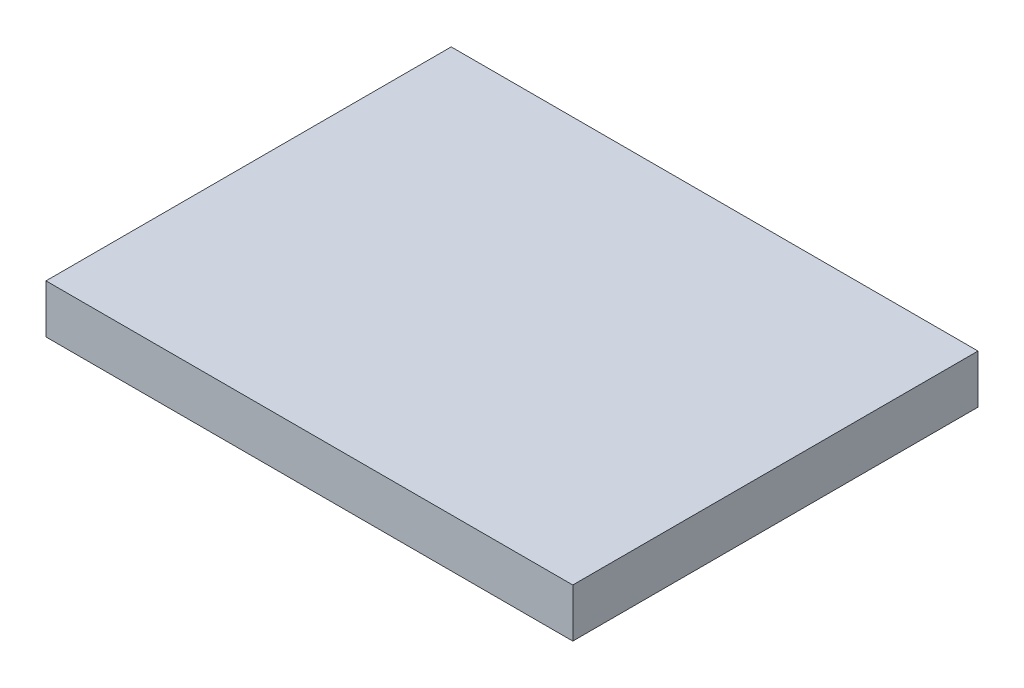
ISO-10303-21;
HEADER;
FILE_DESCRIPTION(('STEP AP214'),'2;1');
FILE_NAME('part.step','',(''),(''),'','','');
FILE_SCHEMA(('AUTOMOTIVE_DESIGN { 1 0 10303 214 1 1 1 1 }'));
ENDSEC;
DATA;
#1=APPLICATION_CONTEXT('core data for automotive mechanical design processes');
#2=APPLICATION_PROTOCOL_DEFINITION('international standard','automotive_design',2000,#1);
#3=PRODUCT_CONTEXT('',#1,'mechanical');
#4=PRODUCT('Part','Part','',(#3));
#5=PRODUCT_RELATED_PRODUCT_CATEGORY('part','',(#4));
#6=PRODUCT_DEFINITION_FORMATION('','',#4);
#7=PRODUCT_DEFINITION_CONTEXT('part definition',#1,'design');
#8=PRODUCT_DEFINITION('design','',#6,#7);
#9=PRODUCT_DEFINITION_SHAPE('','',#8);
#10=(LENGTH_UNIT() NAMED_UNIT(*) SI_UNIT(.MILLI.,.METRE.));
#11=(NAMED_UNIT(*) PLANE_ANGLE_UNIT() SI_UNIT($,.RADIAN.));
#12=(NAMED_UNIT(*) SI_UNIT($,.STERADIAN.) SOLID_ANGLE_UNIT());
#13=UNCERTAINTY_MEASURE_WITH_UNIT(LENGTH_MEASURE(1.E-05),#10,'distance_accuracy_value','');
#14=(GEOMETRIC_REPRESENTATION_CONTEXT(3) GLOBAL_UNCERTAINTY_ASSIGNED_CONTEXT((#13)) GLOBAL_UNIT_ASSIGNED_CONTEXT((#10,
#11,#12)) REPRESENTATION_CONTEXT('',''));
#15=CARTESIAN_POINT('',(0.,0.,0.));
#16=DIRECTION('',(0.,0.,1.));
#17=DIRECTION('',(1.,0.,0.));
#18=AXIS2_PLACEMENT_3D('',#15,#16,#17);
#19=CARTESIAN_POINT('',(0.,12.,0.));
#20=DIRECTION('',(1.,0.,0.));
#21=DIRECTION('',(0.,0.,-1.));
#22=AXIS2_PLACEMENT_3D('',#19,#20,#21);
#23=PLANE('',#22);
#24=DIRECTION('',(0.,0.,1.));
#25=VECTOR('',#24,1.);
#26=CARTESIAN_POINT('',(0.,0.,0.));
#27=LINE('',#26,#25);
#28=CARTESIAN_POINT('',(0.,0.,-100.));
#29=VERTEX_POINT('',#28);
#30=CARTESIAN_POINT('',(0.,0.,0.));
#31=VERTEX_POINT('',#30);
#32=EDGE_CURVE('E96',#29,#31,#27,.T.);
#33=ORIENTED_EDGE('',*,*,#32,.T.);
#34=DIRECTION('',(0.,-1.,0.));
#35=VECTOR('',#34,1.);
#36=CARTESIAN_POINT('',(0.,12.,0.));
#37=LINE('',#36,#35);
#38=CARTESIAN_POINT('',(0.,12.,0.));
#39=VERTEX_POINT('',#38);
#40=EDGE_CURVE('E11',#39,#31,#37,.T.);
#41=ORIENTED_EDGE('',*,*,#40,.F.);
#42=DIRECTION('',(0.,0.,1.));
#43=VECTOR('',#42,1.);
#44=CARTESIAN_POINT('',(0.,12.,0.));
#45=LINE('',#44,#43);
#46=CARTESIAN_POINT('',(0.,12.,-100.));
#47=VERTEX_POINT('',#46);
#48=EDGE_CURVE('E84',#47,#39,#45,.T.);
#49=ORIENTED_EDGE('',*,*,#48,.F.);
#50=DIRECTION('',(0.,-1.,0.));
#51=VECTOR('',#50,1.);
#52=CARTESIAN_POINT('',(0.,12.,-100.));
#53=LINE('',#52,#51);
#54=EDGE_CURVE('E92',#47,#29,#53,.T.);
#55=ORIENTED_EDGE('',*,*,#54,.T.);
#56=EDGE_LOOP('',(#33,#41,#49,#55));
#57=FACE_BOUND('',#56,.T.);
#58=ADVANCED_FACE('F33',(#57),#23,.F.);
#59=CARTESIAN_POINT('',(0.,12.,0.));
#60=DIRECTION('',(0.,0.,-1.));
#61=DIRECTION('',(-1.,0.,0.));
#62=AXIS2_PLACEMENT_3D('',#59,#60,#61);
#63=PLANE('',#62);
#64=DIRECTION('',(1.,0.,0.));
#65=VECTOR('',#64,1.);
#66=CARTESIAN_POINT('',(0.,0.,0.));
#67=LINE('',#66,#65);
#68=CARTESIAN_POINT('',(130.,0.,0.));
#69=VERTEX_POINT('',#68);
#70=EDGE_CURVE('E88',#31,#69,#67,.T.);
#71=ORIENTED_EDGE('',*,*,#70,.T.);
#72=DIRECTION('',(0.,-1.,0.));
#73=VECTOR('',#72,1.);
#74=CARTESIAN_POINT('',(130.,12.,0.));
#75=LINE('',#74,#73);
#76=CARTESIAN_POINT('',(130.,12.,0.));
#77=VERTEX_POINT('',#76);
#78=EDGE_CURVE('E41',#77,#69,#75,.T.);
#79=ORIENTED_EDGE('',*,*,#78,.F.);
#80=DIRECTION('',(1.,0.,0.));
#81=VECTOR('',#80,1.);
#82=CARTESIAN_POINT('',(0.,12.,0.));
#83=LINE('',#82,#81);
#84=EDGE_CURVE('E79',#39,#77,#83,.T.);
#85=ORIENTED_EDGE('',*,*,#84,.F.);
#86=ORIENTED_EDGE('',*,*,#40,.T.);
#87=EDGE_LOOP('',(#71,#79,#85,#86));
#88=FACE_BOUND('',#87,.T.);
#89=ADVANCED_FACE('F87',(#88),#63,.F.);
#90=CARTESIAN_POINT('',(130.,12.,0.));
#91=DIRECTION('',(-1.,0.,0.));
#92=DIRECTION('',(0.,0.,1.));
#93=AXIS2_PLACEMENT_3D('',#90,#91,#92);
#94=PLANE('',#93);
#95=DIRECTION('',(0.,0.,-1.));
#96=VECTOR('',#95,1.);
#97=CARTESIAN_POINT('',(130.,0.,0.));
#98=LINE('',#97,#96);
#99=CARTESIAN_POINT('',(130.,0.,-100.));
#100=VERTEX_POINT('',#99);
#101=EDGE_CURVE('E66',#69,#100,#98,.T.);
#102=ORIENTED_EDGE('',*,*,#101,.T.);
#103=DIRECTION('',(0.,-1.,0.));
#104=VECTOR('',#103,1.);
#105=CARTESIAN_POINT('',(130.,12.,-100.));
#106=LINE('',#105,#104);
#107=CARTESIAN_POINT('',(130.,12.,-100.));
#108=VERTEX_POINT('',#107);
#109=EDGE_CURVE('E89',#108,#100,#106,.T.);
#110=ORIENTED_EDGE('',*,*,#109,.F.);
#111=DIRECTION('',(0.,0.,-1.));
#112=VECTOR('',#111,1.);
#113=CARTESIAN_POINT('',(130.,12.,0.));
#114=LINE('',#113,#112);
#115=EDGE_CURVE('E82',#77,#108,#114,.T.);
#116=ORIENTED_EDGE('',*,*,#115,.F.);
#117=ORIENTED_EDGE('',*,*,#78,.T.);
#118=EDGE_LOOP('',(#102,#110,#116,#117));
#119=FACE_BOUND('',#118,.T.);
#120=ADVANCED_FACE('F90',(#119),#94,.F.);
#121=CARTESIAN_POINT('',(0.,12.,-100.));
#122=DIRECTION('',(0.,0.,1.));
#123=DIRECTION('',(1.,0.,0.));
#124=AXIS2_PLACEMENT_3D('',#121,#122,#123);
#125=PLANE('',#124);
#126=DIRECTION('',(-1.,0.,0.));
#127=VECTOR('',#126,1.);
#128=CARTESIAN_POINT('',(0.,0.,-100.));
#129=LINE('',#128,#127);
#130=EDGE_CURVE('E72',#100,#29,#129,.T.);
#131=ORIENTED_EDGE('',*,*,#130,.T.);
#132=ORIENTED_EDGE('',*,*,#54,.F.);
#133=DIRECTION('',(-1.,0.,0.));
#134=VECTOR('',#133,1.);
#135=CARTESIAN_POINT('',(0.,12.,-100.));
#136=LINE('',#135,#134);
#137=EDGE_CURVE('E49',#108,#47,#136,.T.);
#138=ORIENTED_EDGE('',*,*,#137,.F.);
#139=ORIENTED_EDGE('',*,*,#109,.T.);
#140=EDGE_LOOP('',(#131,#132,#138,#139));
#141=FACE_BOUND('',#140,.T.);
#142=ADVANCED_FACE('F103',(#141),#125,.F.);
#143=CARTESIAN_POINT('',(0.,12.,0.));
#144=DIRECTION('',(0.,-1.,0.));
#145=DIRECTION('',(0.,0.,-1.));
#146=AXIS2_PLACEMENT_3D('',#143,#144,#145);
#147=PLANE('',#146);
#148=ORIENTED_EDGE('',*,*,#48,.T.);
#149=ORIENTED_EDGE('',*,*,#84,.T.);
#150=ORIENTED_EDGE('',*,*,#115,.T.);
#151=ORIENTED_EDGE('',*,*,#137,.T.);
#152=EDGE_LOOP('',(#148,#149,#150,#151));
#153=FACE_BOUND('',#152,.T.);
#154=ADVANCED_FACE('F80',(#153),#147,.F.);
#155=CARTESIAN_POINT('',(0.,0.,0.));
#156=DIRECTION('',(0.,-1.,0.));
#157=DIRECTION('',(0.,0.,-1.));
#158=AXIS2_PLACEMENT_3D('',#155,#156,#157);
#159=PLANE('',#158);
#160=ORIENTED_EDGE('',*,*,#32,.F.);
#161=ORIENTED_EDGE('',*,*,#130,.F.);
#162=ORIENTED_EDGE('',*,*,#101,.F.);
#163=ORIENTED_EDGE('',*,*,#70,.F.);
#164=EDGE_LOOP('',(#160,#161,#162,#163));
#165=FACE_BOUND('',#164,.T.);
#166=ADVANCED_FACE('F106',(#165),#159,.T.);
#167=CLOSED_SHELL('',(#58,#89,#120,#142,#154,#166));
#168=MANIFOLD_SOLID_BREP('B2',#167);
#169=ADVANCED_BREP_SHAPE_REPRESENTATION('',(#18,#168),#14);
#170=SHAPE_DEFINITION_REPRESENTATION(#9,#169);
ENDSEC;
END-ISO-10303-21;
